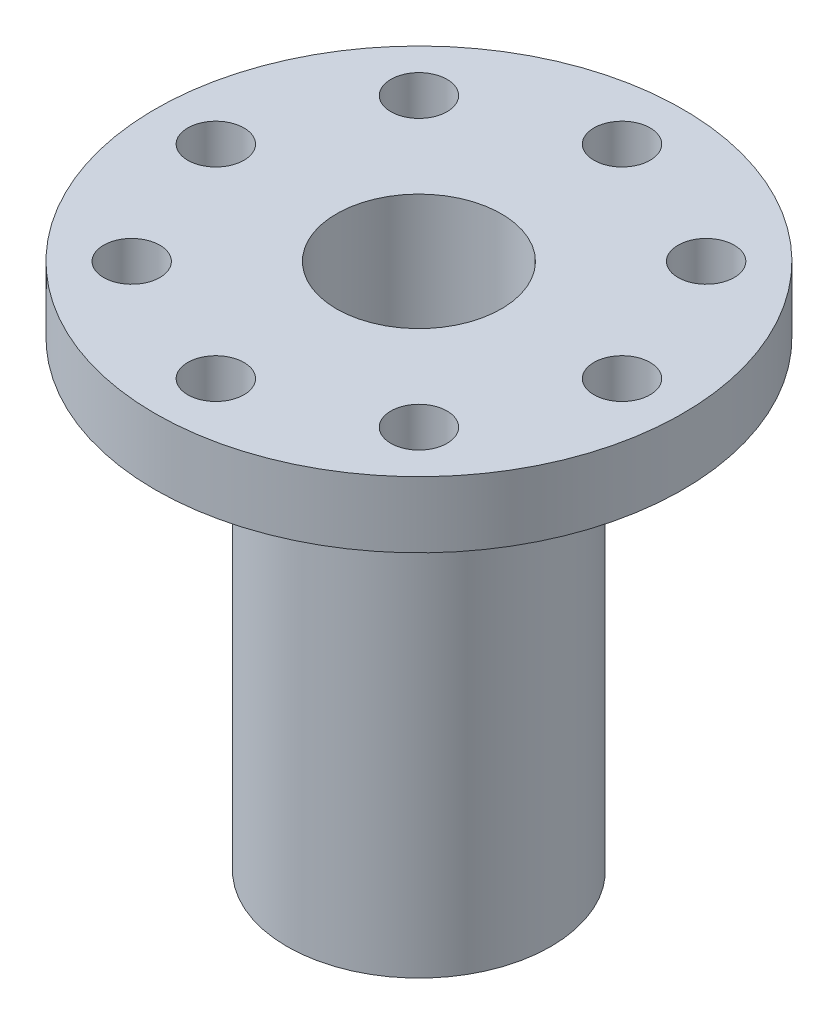
ISO-10303-21;
HEADER;
FILE_DESCRIPTION(('STEP AP214'),'2;1');
FILE_NAME('part.step','',(''),(''),'','','');
FILE_SCHEMA(('AUTOMOTIVE_DESIGN { 1 0 10303 214 1 1 1 1 }'));
ENDSEC;
DATA;
#1=APPLICATION_CONTEXT('core data for automotive mechanical design processes');
#2=APPLICATION_PROTOCOL_DEFINITION('international standard','automotive_design',2000,#1);
#3=PRODUCT_CONTEXT('',#1,'mechanical');
#4=PRODUCT('Part','Part','',(#3));
#5=PRODUCT_RELATED_PRODUCT_CATEGORY('part','',(#4));
#6=PRODUCT_DEFINITION_FORMATION('','',#4);
#7=PRODUCT_DEFINITION_CONTEXT('part definition',#1,'design');
#8=PRODUCT_DEFINITION('design','',#6,#7);
#9=PRODUCT_DEFINITION_SHAPE('','',#8);
#10=(LENGTH_UNIT() NAMED_UNIT(*) SI_UNIT(.MILLI.,.METRE.));
#11=(NAMED_UNIT(*) PLANE_ANGLE_UNIT() SI_UNIT($,.RADIAN.));
#12=(NAMED_UNIT(*) SI_UNIT($,.STERADIAN.) SOLID_ANGLE_UNIT());
#13=UNCERTAINTY_MEASURE_WITH_UNIT(LENGTH_MEASURE(1.E-05),#10,'distance_accuracy_value','');
#14=(GEOMETRIC_REPRESENTATION_CONTEXT(3) GLOBAL_UNCERTAINTY_ASSIGNED_CONTEXT((#13)) GLOBAL_UNIT_ASSIGNED_CONTEXT((#10,
#11,#12)) REPRESENTATION_CONTEXT('',''));
#15=CARTESIAN_POINT('',(0.,0.,0.));
#16=DIRECTION('',(0.,0.,1.));
#17=DIRECTION('',(1.,0.,0.));
#18=AXIS2_PLACEMENT_3D('',#15,#16,#17);
#19=CARTESIAN_POINT('',(0.,3.175,0.));
#20=DIRECTION('',(0.,-1.,0.));
#21=DIRECTION('',(0.,0.,-1.));
#22=AXIS2_PLACEMENT_3D('',#19,#20,#21);
#23=CYLINDRICAL_SURFACE('',#22,12.7);
#24=CARTESIAN_POINT('',(0.,3.175,0.));
#25=DIRECTION('',(0.,1.,0.));
#26=DIRECTION('',(0.,0.,1.));
#27=AXIS2_PLACEMENT_3D('',#24,#25,#26);
#28=CIRCLE('',#27,12.7);
#29=CARTESIAN_POINT('',(0.,3.175,12.7));
#30=VERTEX_POINT('',#29);
#31=EDGE_CURVE('E10',#30,#30,#28,.T.);
#32=ORIENTED_EDGE('',*,*,#31,.F.);
#33=EDGE_LOOP('',(#32));
#34=FACE_BOUND('',#33,.T.);
#35=CARTESIAN_POINT('',(0.,0.,0.));
#36=DIRECTION('',(0.,1.,0.));
#37=DIRECTION('',(0.,0.,1.));
#38=AXIS2_PLACEMENT_3D('',#35,#36,#37);
#39=CIRCLE('',#38,12.7);
#40=CARTESIAN_POINT('',(0.,0.,12.7));
#41=VERTEX_POINT('',#40);
#42=EDGE_CURVE('E36',#41,#41,#39,.T.);
#43=ORIENTED_EDGE('',*,*,#42,.T.);
#44=EDGE_LOOP('',(#43));
#45=FACE_BOUND('',#44,.T.);
#46=ADVANCED_FACE('F33',(#34,#45),#23,.T.);
#47=CARTESIAN_POINT('',(0.,3.175,0.));
#48=DIRECTION('',(0.,1.,0.));
#49=DIRECTION('',(0.,0.,1.));
#50=AXIS2_PLACEMENT_3D('',#47,#48,#49);
#51=PLANE('',#50);
#52=CARTESIAN_POINT('',(0.,3.175,-9.779));
#53=DIRECTION('',(0.,1.,0.));
#54=DIRECTION('',(0.,0.,1.));
#55=AXIS2_PLACEMENT_3D('',#52,#53,#54);
#56=CIRCLE('',#55,1.35255);
#57=CARTESIAN_POINT('',(0.,3.175,-8.42645));
#58=VERTEX_POINT('',#57);
#59=EDGE_CURVE('E113',#58,#58,#56,.T.);
#60=ORIENTED_EDGE('',*,*,#59,.F.);
#61=EDGE_LOOP('',(#60));
#62=FACE_BOUND('',#61,.T.);
#63=CARTESIAN_POINT('',(6.91479721322326,3.175,-6.91479721322324));
#64=DIRECTION('',(0.,1.,0.));
#65=DIRECTION('',(0.,0.,1.));
#66=AXIS2_PLACEMENT_3D('',#63,#64,#65);
#67=CIRCLE('',#66,1.35255);
#68=CARTESIAN_POINT('',(6.91479721322326,3.175,-5.56224721322324));
#69=VERTEX_POINT('',#68);
#70=EDGE_CURVE('E107',#69,#69,#67,.T.);
#71=ORIENTED_EDGE('',*,*,#70,.F.);
#72=EDGE_LOOP('',(#71));
#73=FACE_BOUND('',#72,.T.);
#74=CARTESIAN_POINT('',(9.779,3.175,0.));
#75=DIRECTION('',(0.,1.,0.));
#76=DIRECTION('',(0.,0.,1.));
#77=AXIS2_PLACEMENT_3D('',#74,#75,#76);
#78=CIRCLE('',#77,1.35255);
#79=CARTESIAN_POINT('',(9.779,3.175,1.35255000000003));
#80=VERTEX_POINT('',#79);
#81=EDGE_CURVE('E101',#80,#80,#78,.T.);
#82=ORIENTED_EDGE('',*,*,#81,.F.);
#83=EDGE_LOOP('',(#82));
#84=FACE_BOUND('',#83,.T.);
#85=CARTESIAN_POINT('',(6.91479721322321,3.175,6.91479721322328));
#86=DIRECTION('',(0.,1.,0.));
#87=DIRECTION('',(0.,0.,1.));
#88=AXIS2_PLACEMENT_3D('',#85,#86,#87);
#89=CIRCLE('',#88,1.35255);
#90=CARTESIAN_POINT('',(6.91479721322321,3.175,8.26734721322328));
#91=VERTEX_POINT('',#90);
#92=EDGE_CURVE('E95',#91,#91,#89,.T.);
#93=ORIENTED_EDGE('',*,*,#92,.F.);
#94=EDGE_LOOP('',(#93));
#95=FACE_BOUND('',#94,.T.);
#96=CARTESIAN_POINT('',(0.,3.175,9.779));
#97=DIRECTION('',(0.,1.,0.));
#98=DIRECTION('',(0.,0.,1.));
#99=AXIS2_PLACEMENT_3D('',#96,#97,#98);
#100=CIRCLE('',#99,1.35255);
#101=CARTESIAN_POINT('',(0.,3.175,11.13155));
#102=VERTEX_POINT('',#101);
#103=EDGE_CURVE('E89',#102,#102,#100,.T.);
#104=ORIENTED_EDGE('',*,*,#103,.F.);
#105=EDGE_LOOP('',(#104));
#106=FACE_BOUND('',#105,.T.);
#107=CARTESIAN_POINT('',(-6.91479721322331,3.175,6.91479721322319));
#108=DIRECTION('',(0.,1.,0.));
#109=DIRECTION('',(0.,0.,1.));
#110=AXIS2_PLACEMENT_3D('',#107,#108,#109);
#111=CIRCLE('',#110,1.35255);
#112=CARTESIAN_POINT('',(-6.91479721322331,3.175,8.26734721322319));
#113=VERTEX_POINT('',#112);
#114=EDGE_CURVE('E83',#113,#113,#111,.T.);
#115=ORIENTED_EDGE('',*,*,#114,.F.);
#116=EDGE_LOOP('',(#115));
#117=FACE_BOUND('',#116,.T.);
#118=CARTESIAN_POINT('',(-9.779,3.175,-1.02429588037641E-13));
#119=DIRECTION('',(0.,1.,0.));
#120=DIRECTION('',(0.,0.,1.));
#121=AXIS2_PLACEMENT_3D('',#118,#119,#120);
#122=CIRCLE('',#121,1.35255);
#123=CARTESIAN_POINT('',(-9.779,3.175,1.3525499999999));
#124=VERTEX_POINT('',#123);
#125=EDGE_CURVE('E77',#124,#124,#122,.T.);
#126=ORIENTED_EDGE('',*,*,#125,.F.);
#127=EDGE_LOOP('',(#126));
#128=FACE_BOUND('',#127,.T.);
#129=CARTESIAN_POINT('',(-6.91479721322316,3.175,-6.91479721322333));
#130=DIRECTION('',(0.,1.,0.));
#131=DIRECTION('',(0.,0.,1.));
#132=AXIS2_PLACEMENT_3D('',#129,#130,#131);
#133=CIRCLE('',#132,1.35255);
#134=CARTESIAN_POINT('',(-6.91479721322316,3.175,-5.56224721322333));
#135=VERTEX_POINT('',#134);
#136=EDGE_CURVE('E71',#135,#135,#133,.T.);
#137=ORIENTED_EDGE('',*,*,#136,.F.);
#138=EDGE_LOOP('',(#137));
#139=FACE_BOUND('',#138,.T.);
#140=CARTESIAN_POINT('',(0.,3.175,0.));
#141=DIRECTION('',(0.,1.,0.));
#142=DIRECTION('',(0.,0.,1.));
#143=AXIS2_PLACEMENT_3D('',#140,#141,#142);
#144=CIRCLE('',#143,3.96875);
#145=CARTESIAN_POINT('',(0.,3.175,3.96875));
#146=VERTEX_POINT('',#145);
#147=EDGE_CURVE('E57',#146,#146,#144,.T.);
#148=ORIENTED_EDGE('',*,*,#147,.F.);
#149=EDGE_LOOP('',(#148));
#150=FACE_BOUND('',#149,.T.);
#151=ORIENTED_EDGE('',*,*,#31,.T.);
#152=EDGE_LOOP('',(#151));
#153=FACE_BOUND('',#152,.T.);
#154=ADVANCED_FACE('F119',(#62,#73,#84,#95,#106,#117,#128,#139,#150,#153),#51,.T.);
#155=CARTESIAN_POINT('',(0.,0.,0.));
#156=DIRECTION('',(0.,1.,0.));
#157=DIRECTION('',(0.,0.,1.));
#158=AXIS2_PLACEMENT_3D('',#155,#156,#157);
#159=PLANE('',#158);
#160=CARTESIAN_POINT('',(0.,0.,-9.779));
#161=DIRECTION('',(0.,1.,0.));
#162=DIRECTION('',(0.,0.,1.));
#163=AXIS2_PLACEMENT_3D('',#160,#161,#162);
#164=CIRCLE('',#163,1.35255);
#165=CARTESIAN_POINT('',(0.,0.,-8.42645));
#166=VERTEX_POINT('',#165);
#167=EDGE_CURVE('E110',#166,#166,#164,.T.);
#168=ORIENTED_EDGE('',*,*,#167,.T.);
#169=EDGE_LOOP('',(#168));
#170=FACE_BOUND('',#169,.T.);
#171=CARTESIAN_POINT('',(6.91479721322326,0.,-6.91479721322324));
#172=DIRECTION('',(0.,1.,0.));
#173=DIRECTION('',(0.,0.,1.));
#174=AXIS2_PLACEMENT_3D('',#171,#172,#173);
#175=CIRCLE('',#174,1.35255);
#176=CARTESIAN_POINT('',(6.91479721322326,0.,-5.56224721322324));
#177=VERTEX_POINT('',#176);
#178=EDGE_CURVE('E104',#177,#177,#175,.T.);
#179=ORIENTED_EDGE('',*,*,#178,.T.);
#180=EDGE_LOOP('',(#179));
#181=FACE_BOUND('',#180,.T.);
#182=CARTESIAN_POINT('',(9.779,0.,0.));
#183=DIRECTION('',(0.,1.,0.));
#184=DIRECTION('',(0.,0.,1.));
#185=AXIS2_PLACEMENT_3D('',#182,#183,#184);
#186=CIRCLE('',#185,1.35255);
#187=CARTESIAN_POINT('',(9.779,0.,1.35255000000003));
#188=VERTEX_POINT('',#187);
#189=EDGE_CURVE('E98',#188,#188,#186,.T.);
#190=ORIENTED_EDGE('',*,*,#189,.T.);
#191=EDGE_LOOP('',(#190));
#192=FACE_BOUND('',#191,.T.);
#193=CARTESIAN_POINT('',(6.91479721322321,0.,6.91479721322328));
#194=DIRECTION('',(0.,1.,0.));
#195=DIRECTION('',(0.,0.,1.));
#196=AXIS2_PLACEMENT_3D('',#193,#194,#195);
#197=CIRCLE('',#196,1.35255);
#198=CARTESIAN_POINT('',(6.91479721322321,0.,8.26734721322328));
#199=VERTEX_POINT('',#198);
#200=EDGE_CURVE('E92',#199,#199,#197,.T.);
#201=ORIENTED_EDGE('',*,*,#200,.T.);
#202=EDGE_LOOP('',(#201));
#203=FACE_BOUND('',#202,.T.);
#204=CARTESIAN_POINT('',(0.,0.,9.779));
#205=DIRECTION('',(0.,1.,0.));
#206=DIRECTION('',(0.,0.,1.));
#207=AXIS2_PLACEMENT_3D('',#204,#205,#206);
#208=CIRCLE('',#207,1.35255);
#209=CARTESIAN_POINT('',(0.,0.,11.13155));
#210=VERTEX_POINT('',#209);
#211=EDGE_CURVE('E86',#210,#210,#208,.T.);
#212=ORIENTED_EDGE('',*,*,#211,.T.);
#213=EDGE_LOOP('',(#212));
#214=FACE_BOUND('',#213,.T.);
#215=CARTESIAN_POINT('',(-6.91479721322331,0.,6.91479721322319));
#216=DIRECTION('',(0.,1.,0.));
#217=DIRECTION('',(0.,0.,1.));
#218=AXIS2_PLACEMENT_3D('',#215,#216,#217);
#219=CIRCLE('',#218,1.35255);
#220=CARTESIAN_POINT('',(-6.91479721322331,0.,8.26734721322319));
#221=VERTEX_POINT('',#220);
#222=EDGE_CURVE('E80',#221,#221,#219,.T.);
#223=ORIENTED_EDGE('',*,*,#222,.T.);
#224=EDGE_LOOP('',(#223));
#225=FACE_BOUND('',#224,.T.);
#226=CARTESIAN_POINT('',(-9.779,0.,-1.02429588037641E-13));
#227=DIRECTION('',(0.,1.,0.));
#228=DIRECTION('',(0.,0.,1.));
#229=AXIS2_PLACEMENT_3D('',#226,#227,#228);
#230=CIRCLE('',#229,1.35255);
#231=CARTESIAN_POINT('',(-9.779,0.,1.3525499999999));
#232=VERTEX_POINT('',#231);
#233=EDGE_CURVE('E74',#232,#232,#230,.T.);
#234=ORIENTED_EDGE('',*,*,#233,.T.);
#235=EDGE_LOOP('',(#234));
#236=FACE_BOUND('',#235,.T.);
#237=CARTESIAN_POINT('',(-6.91479721322316,0.,-6.91479721322333));
#238=DIRECTION('',(0.,1.,0.));
#239=DIRECTION('',(0.,0.,1.));
#240=AXIS2_PLACEMENT_3D('',#237,#238,#239);
#241=CIRCLE('',#240,1.35255);
#242=CARTESIAN_POINT('',(-6.91479721322316,0.,-5.56224721322333));
#243=VERTEX_POINT('',#242);
#244=EDGE_CURVE('E66',#243,#243,#241,.T.);
#245=ORIENTED_EDGE('',*,*,#244,.T.);
#246=EDGE_LOOP('',(#245));
#247=FACE_BOUND('',#246,.T.);
#248=CARTESIAN_POINT('',(0.,0.,0.));
#249=DIRECTION('',(0.,1.,0.));
#250=DIRECTION('',(0.,0.,1.));
#251=AXIS2_PLACEMENT_3D('',#248,#249,#250);
#252=CIRCLE('',#251,6.35);
#253=CARTESIAN_POINT('',(0.,0.,6.35));
#254=VERTEX_POINT('',#253);
#255=EDGE_CURVE('E45',#254,#254,#252,.T.);
#256=ORIENTED_EDGE('',*,*,#255,.T.);
#257=EDGE_LOOP('',(#256));
#258=FACE_BOUND('',#257,.T.);
#259=ORIENTED_EDGE('',*,*,#42,.F.);
#260=EDGE_LOOP('',(#259));
#261=FACE_BOUND('',#260,.T.);
#262=ADVANCED_FACE('F122',(#170,#181,#192,#203,#214,#225,#236,#247,#258,#261),#159,.F.);
#263=CARTESIAN_POINT('',(0.,-22.225,0.));
#264=DIRECTION('',(0.,1.,0.));
#265=DIRECTION('',(0.,0.,1.));
#266=AXIS2_PLACEMENT_3D('',#263,#264,#265);
#267=CYLINDRICAL_SURFACE('',#266,6.35);
#268=CARTESIAN_POINT('',(0.,-22.225,0.));
#269=DIRECTION('',(0.,1.,0.));
#270=DIRECTION('',(0.,0.,1.));
#271=AXIS2_PLACEMENT_3D('',#268,#269,#270);
#272=CIRCLE('',#271,6.35);
#273=CARTESIAN_POINT('',(0.,-22.225,6.35));
#274=VERTEX_POINT('',#273);
#275=EDGE_CURVE('E43',#274,#274,#272,.T.);
#276=ORIENTED_EDGE('',*,*,#275,.T.);
#277=EDGE_LOOP('',(#276));
#278=FACE_BOUND('',#277,.T.);
#279=ORIENTED_EDGE('',*,*,#255,.F.);
#280=EDGE_LOOP('',(#279));
#281=FACE_BOUND('',#280,.T.);
#282=ADVANCED_FACE('F165',(#278,#281),#267,.T.);
#283=CARTESIAN_POINT('',(0.,-22.225,0.));
#284=DIRECTION('',(0.,1.,0.));
#285=DIRECTION('',(0.,0.,1.));
#286=AXIS2_PLACEMENT_3D('',#283,#284,#285);
#287=PLANE('',#286);
#288=CARTESIAN_POINT('',(0.,-22.225,0.));
#289=DIRECTION('',(0.,-1.,0.));
#290=DIRECTION('',(0.,0.,-1.));
#291=AXIS2_PLACEMENT_3D('',#288,#289,#290);
#292=CIRCLE('',#291,3.);
#293=CARTESIAN_POINT('',(0.,-22.225,-3.));
#294=VERTEX_POINT('',#293);
#295=EDGE_CURVE('E51',#294,#294,#292,.T.);
#296=ORIENTED_EDGE('',*,*,#295,.F.);
#297=EDGE_LOOP('',(#296));
#298=FACE_BOUND('',#297,.T.);
#299=ORIENTED_EDGE('',*,*,#275,.F.);
#300=EDGE_LOOP('',(#299));
#301=FACE_BOUND('',#300,.T.);
#302=ADVANCED_FACE('F170',(#298,#301),#287,.F.);
#303=CARTESIAN_POINT('',(0.,-19.05,0.));
#304=DIRECTION('',(0.,-1.,0.));
#305=DIRECTION('',(0.,0.,-1.));
#306=AXIS2_PLACEMENT_3D('',#303,#304,#305);
#307=CYLINDRICAL_SURFACE('',#306,3.);
#308=CARTESIAN_POINT('',(0.,-19.05,0.));
#309=DIRECTION('',(0.,-1.,0.));
#310=DIRECTION('',(0.,0.,-1.));
#311=AXIS2_PLACEMENT_3D('',#308,#309,#310);
#312=CIRCLE('',#311,3.);
#313=CARTESIAN_POINT('',(0.,-19.05,-3.));
#314=VERTEX_POINT('',#313);
#315=EDGE_CURVE('E48',#314,#314,#312,.T.);
#316=ORIENTED_EDGE('',*,*,#315,.F.);
#317=EDGE_LOOP('',(#316));
#318=FACE_BOUND('',#317,.T.);
#319=ORIENTED_EDGE('',*,*,#295,.T.);
#320=EDGE_LOOP('',(#319));
#321=FACE_BOUND('',#320,.T.);
#322=ADVANCED_FACE('F153',(#318,#321),#307,.F.);
#323=CARTESIAN_POINT('',(0.,-19.05,0.));
#324=DIRECTION('',(0.,-1.,0.));
#325=DIRECTION('',(0.,0.,-1.));
#326=AXIS2_PLACEMENT_3D('',#323,#324,#325);
#327=PLANE('',#326);
#328=CARTESIAN_POINT('',(0.,-19.05,0.));
#329=DIRECTION('',(0.,-1.,0.));
#330=DIRECTION('',(0.,0.,-1.));
#331=AXIS2_PLACEMENT_3D('',#328,#329,#330);
#332=CIRCLE('',#331,1.6);
#333=CARTESIAN_POINT('',(0.,-19.05,-1.6));
#334=VERTEX_POINT('',#333);
#335=EDGE_CURVE('E63',#334,#334,#332,.F.);
#336=ORIENTED_EDGE('',*,*,#335,.T.);
#337=EDGE_LOOP('',(#336));
#338=FACE_BOUND('',#337,.T.);
#339=ORIENTED_EDGE('',*,*,#315,.T.);
#340=EDGE_LOOP('',(#339));
#341=FACE_BOUND('',#340,.T.);
#342=ADVANCED_FACE('F143',(#338,#341),#327,.T.);
#343=CARTESIAN_POINT('',(0.,-15.875,0.));
#344=DIRECTION('',(0.,1.,0.));
#345=DIRECTION('',(0.,0.,1.));
#346=AXIS2_PLACEMENT_3D('',#343,#344,#345);
#347=CYLINDRICAL_SURFACE('',#346,3.96875);
#348=CARTESIAN_POINT('',(0.,-15.875,0.));
#349=DIRECTION('',(0.,1.,0.));
#350=DIRECTION('',(0.,0.,1.));
#351=AXIS2_PLACEMENT_3D('',#348,#349,#350);
#352=CIRCLE('',#351,3.96875);
#353=CARTESIAN_POINT('',(0.,-15.875,3.96875));
#354=VERTEX_POINT('',#353);
#355=EDGE_CURVE('E54',#354,#354,#352,.T.);
#356=ORIENTED_EDGE('',*,*,#355,.F.);
#357=EDGE_LOOP('',(#356));
#358=FACE_BOUND('',#357,.T.);
#359=ORIENTED_EDGE('',*,*,#147,.T.);
#360=EDGE_LOOP('',(#359));
#361=FACE_BOUND('',#360,.T.);
#362=ADVANCED_FACE('F140',(#358,#361),#347,.F.);
#363=CARTESIAN_POINT('',(0.,-15.875,0.));
#364=DIRECTION('',(0.,1.,0.));
#365=DIRECTION('',(0.,0.,1.));
#366=AXIS2_PLACEMENT_3D('',#363,#364,#365);
#367=PLANE('',#366);
#368=CARTESIAN_POINT('',(0.,-15.875,0.));
#369=DIRECTION('',(0.,1.,0.));
#370=DIRECTION('',(0.,0.,1.));
#371=AXIS2_PLACEMENT_3D('',#368,#369,#370);
#372=CIRCLE('',#371,1.6);
#373=CARTESIAN_POINT('',(0.,-15.875,1.6));
#374=VERTEX_POINT('',#373);
#375=EDGE_CURVE('E60',#374,#374,#372,.T.);
#376=ORIENTED_EDGE('',*,*,#375,.F.);
#377=EDGE_LOOP('',(#376));
#378=FACE_BOUND('',#377,.T.);
#379=ORIENTED_EDGE('',*,*,#355,.T.);
#380=EDGE_LOOP('',(#379));
#381=FACE_BOUND('',#380,.T.);
#382=ADVANCED_FACE('F142',(#378,#381),#367,.T.);
#383=CARTESIAN_POINT('',(0.,-22.226,0.));
#384=DIRECTION('',(0.,1.,0.));
#385=DIRECTION('',(0.,0.,1.));
#386=AXIS2_PLACEMENT_3D('',#383,#384,#385);
#387=CYLINDRICAL_SURFACE('',#386,1.6);
#388=ORIENTED_EDGE('',*,*,#335,.F.);
#389=EDGE_LOOP('',(#388));
#390=FACE_BOUND('',#389,.T.);
#391=ORIENTED_EDGE('',*,*,#375,.T.);
#392=EDGE_LOOP('',(#391));
#393=FACE_BOUND('',#392,.T.);
#394=ADVANCED_FACE('F150',(#390,#393),#387,.F.);
#395=CARTESIAN_POINT('',(-6.91479721322316,3.175,-6.91479721322333));
#396=DIRECTION('',(0.,1.,0.));
#397=DIRECTION('',(0.,0.,1.));
#398=AXIS2_PLACEMENT_3D('',#395,#396,#397);
#399=CYLINDRICAL_SURFACE('',#398,1.35255);
#400=ORIENTED_EDGE('',*,*,#244,.F.);
#401=EDGE_LOOP('',(#400));
#402=FACE_BOUND('',#401,.T.);
#403=ORIENTED_EDGE('',*,*,#136,.T.);
#404=EDGE_LOOP('',(#403));
#405=FACE_BOUND('',#404,.T.);
#406=ADVANCED_FACE('F214',(#402,#405),#399,.F.);
#407=CARTESIAN_POINT('',(-9.779,3.175,-1.02429588037641E-13));
#408=DIRECTION('',(0.,1.,0.));
#409=DIRECTION('',(0.,0.,1.));
#410=AXIS2_PLACEMENT_3D('',#407,#408,#409);
#411=CYLINDRICAL_SURFACE('',#410,1.35255);
#412=ORIENTED_EDGE('',*,*,#233,.F.);
#413=EDGE_LOOP('',(#412));
#414=FACE_BOUND('',#413,.T.);
#415=ORIENTED_EDGE('',*,*,#125,.T.);
#416=EDGE_LOOP('',(#415));
#417=FACE_BOUND('',#416,.T.);
#418=ADVANCED_FACE('F236',(#414,#417),#411,.F.);
#419=CARTESIAN_POINT('',(-6.91479721322331,3.175,6.91479721322319));
#420=DIRECTION('',(0.,1.,0.));
#421=DIRECTION('',(0.,0.,1.));
#422=AXIS2_PLACEMENT_3D('',#419,#420,#421);
#423=CYLINDRICAL_SURFACE('',#422,1.35255);
#424=ORIENTED_EDGE('',*,*,#222,.F.);
#425=EDGE_LOOP('',(#424));
#426=FACE_BOUND('',#425,.T.);
#427=ORIENTED_EDGE('',*,*,#114,.T.);
#428=EDGE_LOOP('',(#427));
#429=FACE_BOUND('',#428,.T.);
#430=ADVANCED_FACE('F246',(#426,#429),#423,.F.);
#431=CARTESIAN_POINT('',(0.,3.175,9.779));
#432=DIRECTION('',(0.,1.,0.));
#433=DIRECTION('',(0.,0.,1.));
#434=AXIS2_PLACEMENT_3D('',#431,#432,#433);
#435=CYLINDRICAL_SURFACE('',#434,1.35255);
#436=ORIENTED_EDGE('',*,*,#211,.F.);
#437=EDGE_LOOP('',(#436));
#438=FACE_BOUND('',#437,.T.);
#439=ORIENTED_EDGE('',*,*,#103,.T.);
#440=EDGE_LOOP('',(#439));
#441=FACE_BOUND('',#440,.T.);
#442=ADVANCED_FACE('F256',(#438,#441),#435,.F.);
#443=CARTESIAN_POINT('',(6.91479721322321,3.175,6.91479721322328));
#444=DIRECTION('',(0.,1.,0.));
#445=DIRECTION('',(0.,0.,1.));
#446=AXIS2_PLACEMENT_3D('',#443,#444,#445);
#447=CYLINDRICAL_SURFACE('',#446,1.35255);
#448=ORIENTED_EDGE('',*,*,#200,.F.);
#449=EDGE_LOOP('',(#448));
#450=FACE_BOUND('',#449,.T.);
#451=ORIENTED_EDGE('',*,*,#92,.T.);
#452=EDGE_LOOP('',(#451));
#453=FACE_BOUND('',#452,.T.);
#454=ADVANCED_FACE('F266',(#450,#453),#447,.F.);
#455=CARTESIAN_POINT('',(9.779,3.175,0.));
#456=DIRECTION('',(0.,1.,0.));
#457=DIRECTION('',(0.,0.,1.));
#458=AXIS2_PLACEMENT_3D('',#455,#456,#457);
#459=CYLINDRICAL_SURFACE('',#458,1.35255);
#460=ORIENTED_EDGE('',*,*,#189,.F.);
#461=EDGE_LOOP('',(#460));
#462=FACE_BOUND('',#461,.T.);
#463=ORIENTED_EDGE('',*,*,#81,.T.);
#464=EDGE_LOOP('',(#463));
#465=FACE_BOUND('',#464,.T.);
#466=ADVANCED_FACE('F276',(#462,#465),#459,.F.);
#467=CARTESIAN_POINT('',(6.91479721322326,3.175,-6.91479721322324));
#468=DIRECTION('',(0.,1.,0.));
#469=DIRECTION('',(0.,0.,1.));
#470=AXIS2_PLACEMENT_3D('',#467,#468,#469);
#471=CYLINDRICAL_SURFACE('',#470,1.35255);
#472=ORIENTED_EDGE('',*,*,#178,.F.);
#473=EDGE_LOOP('',(#472));
#474=FACE_BOUND('',#473,.T.);
#475=ORIENTED_EDGE('',*,*,#70,.T.);
#476=EDGE_LOOP('',(#475));
#477=FACE_BOUND('',#476,.T.);
#478=ADVANCED_FACE('F286',(#474,#477),#471,.F.);
#479=CARTESIAN_POINT('',(0.,3.175,-9.779));
#480=DIRECTION('',(0.,1.,0.));
#481=DIRECTION('',(0.,0.,1.));
#482=AXIS2_PLACEMENT_3D('',#479,#480,#481);
#483=CYLINDRICAL_SURFACE('',#482,1.35255);
#484=ORIENTED_EDGE('',*,*,#167,.F.);
#485=EDGE_LOOP('',(#484));
#486=FACE_BOUND('',#485,.T.);
#487=ORIENTED_EDGE('',*,*,#59,.T.);
#488=EDGE_LOOP('',(#487));
#489=FACE_BOUND('',#488,.T.);
#490=ADVANCED_FACE('F117',(#486,#489),#483,.F.);
#491=CLOSED_SHELL('',(#46,#154,#262,#282,#302,#322,#342,#362,#382,#394,#406,#418,#430,#442,#454,
#466,#478,#490));
#492=MANIFOLD_SOLID_BREP('B2',#491);
#493=ADVANCED_BREP_SHAPE_REPRESENTATION('',(#18,#492),#14);
#494=SHAPE_DEFINITION_REPRESENTATION(#9,#493);
ENDSEC;
END-ISO-10303-21;
